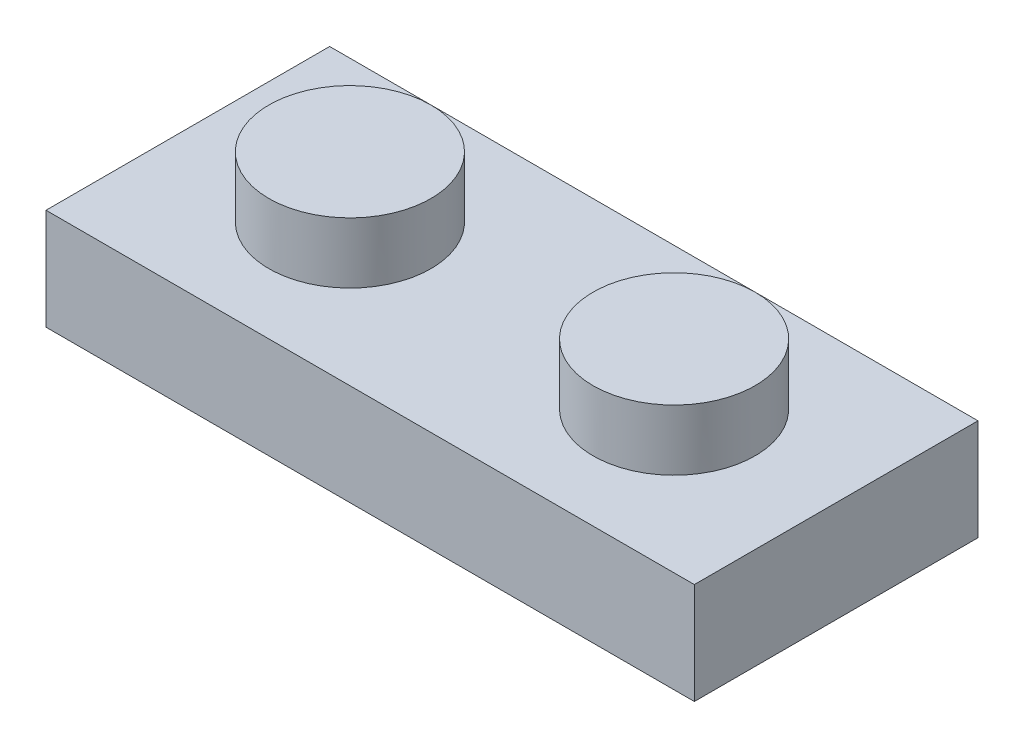
ISO-10303-21;
HEADER;
FILE_DESCRIPTION(('STEP AP214'),'2;1');
FILE_NAME('part.step','',(''),(''),'','','');
FILE_SCHEMA(('AUTOMOTIVE_DESIGN { 1 0 10303 214 1 1 1 1 }'));
ENDSEC;
DATA;
#1=APPLICATION_CONTEXT('core data for automotive mechanical design processes');
#2=APPLICATION_PROTOCOL_DEFINITION('international standard','automotive_design',2000,#1);
#3=PRODUCT_CONTEXT('',#1,'mechanical');
#4=PRODUCT('Part','Part','',(#3));
#5=PRODUCT_RELATED_PRODUCT_CATEGORY('part','',(#4));
#6=PRODUCT_DEFINITION_FORMATION('','',#4);
#7=PRODUCT_DEFINITION_CONTEXT('part definition',#1,'design');
#8=PRODUCT_DEFINITION('design','',#6,#7);
#9=PRODUCT_DEFINITION_SHAPE('','',#8);
#10=(LENGTH_UNIT() NAMED_UNIT(*) SI_UNIT(.MILLI.,.METRE.));
#11=(NAMED_UNIT(*) PLANE_ANGLE_UNIT() SI_UNIT($,.RADIAN.));
#12=(NAMED_UNIT(*) SI_UNIT($,.STERADIAN.) SOLID_ANGLE_UNIT());
#13=UNCERTAINTY_MEASURE_WITH_UNIT(LENGTH_MEASURE(1.E-05),#10,'distance_accuracy_value','');
#14=(GEOMETRIC_REPRESENTATION_CONTEXT(3) GLOBAL_UNCERTAINTY_ASSIGNED_CONTEXT((#13)) GLOBAL_UNIT_ASSIGNED_CONTEXT((#10,
#11,#12)) REPRESENTATION_CONTEXT('',''));
#15=CARTESIAN_POINT('',(0.,0.,0.));
#16=DIRECTION('',(0.,0.,1.));
#17=DIRECTION('',(1.,0.,0.));
#18=AXIS2_PLACEMENT_3D('',#15,#16,#17);
#19=CARTESIAN_POINT('',(-10.16,-3.175,4.445));
#20=DIRECTION('',(1.,0.,0.));
#21=DIRECTION('',(0.,0.,-1.));
#22=AXIS2_PLACEMENT_3D('',#19,#20,#21);
#23=PLANE('',#22);
#24=DIRECTION('',(0.,-1.,0.));
#25=VECTOR('',#24,1.);
#26=CARTESIAN_POINT('',(-10.16,-3.175,-4.445));
#27=LINE('',#26,#25);
#28=CARTESIAN_POINT('',(-10.16,0.,-4.445));
#29=VERTEX_POINT('',#28);
#30=CARTESIAN_POINT('',(-10.16,-3.175,-4.445));
#31=VERTEX_POINT('',#30);
#32=EDGE_CURVE('E176',#29,#31,#27,.T.);
#33=ORIENTED_EDGE('',*,*,#32,.T.);
#34=DIRECTION('',(0.,0.,-1.));
#35=VECTOR('',#34,1.);
#36=CARTESIAN_POINT('',(-10.16,-3.175,4.445));
#37=LINE('',#36,#35);
#38=CARTESIAN_POINT('',(-10.16,-3.175,4.445));
#39=VERTEX_POINT('',#38);
#40=EDGE_CURVE('E208',#39,#31,#37,.T.);
#41=ORIENTED_EDGE('',*,*,#40,.F.);
#42=DIRECTION('',(0.,-1.,0.));
#43=VECTOR('',#42,1.);
#44=CARTESIAN_POINT('',(-10.16,-3.175,4.445));
#45=LINE('',#44,#43);
#46=CARTESIAN_POINT('',(-10.16,0.,4.445));
#47=VERTEX_POINT('',#46);
#48=EDGE_CURVE('E177',#47,#39,#45,.T.);
#49=ORIENTED_EDGE('',*,*,#48,.F.);
#50=DIRECTION('',(0.,0.,-1.));
#51=VECTOR('',#50,1.);
#52=CARTESIAN_POINT('',(-10.16,0.,4.445));
#53=LINE('',#52,#51);
#54=EDGE_CURVE('E187',#47,#29,#53,.T.);
#55=ORIENTED_EDGE('',*,*,#54,.T.);
#56=EDGE_LOOP('',(#33,#41,#49,#55));
#57=FACE_BOUND('',#56,.T.);
#58=ADVANCED_FACE('F38',(#57),#23,.F.);
#59=CARTESIAN_POINT('',(10.16,-3.175,4.445));
#60=DIRECTION('',(0.,1.,0.));
#61=DIRECTION('',(0.,0.,1.));
#62=AXIS2_PLACEMENT_3D('',#59,#60,#61);
#63=PLANE('',#62);
#64=DIRECTION('',(0.,0.,-1.));
#65=VECTOR('',#64,1.);
#66=CARTESIAN_POINT('',(-8.89,-3.175,2.54));
#67=LINE('',#66,#65);
#68=CARTESIAN_POINT('',(-8.89,-3.175,2.54));
#69=VERTEX_POINT('',#68);
#70=CARTESIAN_POINT('',(-8.89,-3.175,-2.54));
#71=VERTEX_POINT('',#70);
#72=EDGE_CURVE('E153',#69,#71,#67,.T.);
#73=ORIENTED_EDGE('',*,*,#72,.F.);
#74=DIRECTION('',(-1.,0.,0.));
#75=VECTOR('',#74,1.);
#76=CARTESIAN_POINT('',(8.89,-3.175,2.54));
#77=LINE('',#76,#75);
#78=CARTESIAN_POINT('',(8.89,-3.175,2.54));
#79=VERTEX_POINT('',#78);
#80=EDGE_CURVE('E53',#79,#69,#77,.T.);
#81=ORIENTED_EDGE('',*,*,#80,.F.);
#82=DIRECTION('',(0.,0.,1.));
#83=VECTOR('',#82,1.);
#84=CARTESIAN_POINT('',(8.89,-3.175,-2.54));
#85=LINE('',#84,#83);
#86=CARTESIAN_POINT('',(8.89,-3.175,-2.54));
#87=VERTEX_POINT('',#86);
#88=EDGE_CURVE('E136',#87,#79,#85,.T.);
#89=ORIENTED_EDGE('',*,*,#88,.F.);
#90=DIRECTION('',(1.,0.,0.));
#91=VECTOR('',#90,1.);
#92=CARTESIAN_POINT('',(-8.89,-3.175,-2.54));
#93=LINE('',#92,#91);
#94=EDGE_CURVE('E141',#71,#87,#93,.T.);
#95=ORIENTED_EDGE('',*,*,#94,.F.);
#96=EDGE_LOOP('',(#73,#81,#89,#95));
#97=FACE_BOUND('',#96,.T.);
#98=DIRECTION('',(1.,0.,0.));
#99=VECTOR('',#98,1.);
#100=CARTESIAN_POINT('',(10.16,-3.175,-4.445));
#101=LINE('',#100,#99);
#102=CARTESIAN_POINT('',(10.16,-3.175,-4.445));
#103=VERTEX_POINT('',#102);
#104=EDGE_CURVE('E191',#31,#103,#101,.T.);
#105=ORIENTED_EDGE('',*,*,#104,.T.);
#106=DIRECTION('',(0.,0.,-1.));
#107=VECTOR('',#106,1.);
#108=CARTESIAN_POINT('',(10.16,-3.175,4.445));
#109=LINE('',#108,#107);
#110=CARTESIAN_POINT('',(10.16,-3.175,4.445));
#111=VERTEX_POINT('',#110);
#112=EDGE_CURVE('E204',#111,#103,#109,.T.);
#113=ORIENTED_EDGE('',*,*,#112,.F.);
#114=DIRECTION('',(1.,0.,0.));
#115=VECTOR('',#114,1.);
#116=CARTESIAN_POINT('',(10.16,-3.175,4.445));
#117=LINE('',#116,#115);
#118=EDGE_CURVE('E91',#39,#111,#117,.T.);
#119=ORIENTED_EDGE('',*,*,#118,.F.);
#120=ORIENTED_EDGE('',*,*,#40,.T.);
#121=EDGE_LOOP('',(#105,#113,#119,#120));
#122=FACE_BOUND('',#121,.T.);
#123=ADVANCED_FACE('F246',(#97,#122),#63,.F.);
#124=CARTESIAN_POINT('',(10.16,0.,4.445));
#125=DIRECTION('',(-1.,0.,0.));
#126=DIRECTION('',(0.,0.,1.));
#127=AXIS2_PLACEMENT_3D('',#124,#125,#126);
#128=PLANE('',#127);
#129=DIRECTION('',(0.,1.,0.));
#130=VECTOR('',#129,1.);
#131=CARTESIAN_POINT('',(10.16,0.,-4.445));
#132=LINE('',#131,#130);
#133=CARTESIAN_POINT('',(10.16,0.,-4.445));
#134=VERTEX_POINT('',#133);
#135=EDGE_CURVE('E194',#103,#134,#132,.T.);
#136=ORIENTED_EDGE('',*,*,#135,.T.);
#137=DIRECTION('',(0.,0.,-1.));
#138=VECTOR('',#137,1.);
#139=CARTESIAN_POINT('',(10.16,0.,4.445));
#140=LINE('',#139,#138);
#141=CARTESIAN_POINT('',(10.16,0.,4.445));
#142=VERTEX_POINT('',#141);
#143=EDGE_CURVE('E201',#142,#134,#140,.T.);
#144=ORIENTED_EDGE('',*,*,#143,.F.);
#145=DIRECTION('',(0.,1.,0.));
#146=VECTOR('',#145,1.);
#147=CARTESIAN_POINT('',(10.16,0.,4.445));
#148=LINE('',#147,#146);
#149=EDGE_CURVE('E182',#111,#142,#148,.T.);
#150=ORIENTED_EDGE('',*,*,#149,.F.);
#151=ORIENTED_EDGE('',*,*,#112,.T.);
#152=EDGE_LOOP('',(#136,#144,#150,#151));
#153=FACE_BOUND('',#152,.T.);
#154=ADVANCED_FACE('F225',(#153),#128,.F.);
#155=CARTESIAN_POINT('',(-10.16,0.,4.445));
#156=DIRECTION('',(0.,-1.,0.));
#157=DIRECTION('',(0.,0.,-1.));
#158=AXIS2_PLACEMENT_3D('',#155,#156,#157);
#159=PLANE('',#158);
#160=CARTESIAN_POINT('',(5.08,0.,0.));
#161=DIRECTION('',(0.,-1.,0.));
#162=DIRECTION('',(0.,0.,-1.));
#163=AXIS2_PLACEMENT_3D('',#160,#161,#162);
#164=CIRCLE('',#163,2.54);
#165=CARTESIAN_POINT('',(5.08,0.,-2.54));
#166=VERTEX_POINT('',#165);
#167=EDGE_CURVE('E46',#166,#166,#164,.F.);
#168=ORIENTED_EDGE('',*,*,#167,.F.);
#169=EDGE_LOOP('',(#168));
#170=FACE_BOUND('',#169,.T.);
#171=CARTESIAN_POINT('',(-5.08,0.,0.));
#172=DIRECTION('',(0.,-1.,0.));
#173=DIRECTION('',(0.,0.,-1.));
#174=AXIS2_PLACEMENT_3D('',#171,#172,#173);
#175=CIRCLE('',#174,2.54);
#176=CARTESIAN_POINT('',(-5.08,0.,-2.54));
#177=VERTEX_POINT('',#176);
#178=EDGE_CURVE('E211',#177,#177,#175,.F.);
#179=ORIENTED_EDGE('',*,*,#178,.F.);
#180=EDGE_LOOP('',(#179));
#181=FACE_BOUND('',#180,.T.);
#182=DIRECTION('',(-1.,0.,0.));
#183=VECTOR('',#182,1.);
#184=CARTESIAN_POINT('',(-10.16,0.,-4.445));
#185=LINE('',#184,#183);
#186=EDGE_CURVE('E83',#134,#29,#185,.T.);
#187=ORIENTED_EDGE('',*,*,#186,.T.);
#188=ORIENTED_EDGE('',*,*,#54,.F.);
#189=DIRECTION('',(-1.,0.,0.));
#190=VECTOR('',#189,1.);
#191=CARTESIAN_POINT('',(-10.16,0.,4.445));
#192=LINE('',#191,#190);
#193=EDGE_CURVE('E62',#142,#47,#192,.T.);
#194=ORIENTED_EDGE('',*,*,#193,.F.);
#195=ORIENTED_EDGE('',*,*,#143,.T.);
#196=EDGE_LOOP('',(#187,#188,#194,#195));
#197=FACE_BOUND('',#196,.T.);
#198=ADVANCED_FACE('F221',(#170,#181,#197),#159,.F.);
#199=CARTESIAN_POINT('',(0.,0.,4.445));
#200=DIRECTION('',(0.,0.,-1.));
#201=DIRECTION('',(-1.,0.,0.));
#202=AXIS2_PLACEMENT_3D('',#199,#200,#201);
#203=PLANE('',#202);
#204=ORIENTED_EDGE('',*,*,#48,.T.);
#205=ORIENTED_EDGE('',*,*,#118,.T.);
#206=ORIENTED_EDGE('',*,*,#149,.T.);
#207=ORIENTED_EDGE('',*,*,#193,.T.);
#208=EDGE_LOOP('',(#204,#205,#206,#207));
#209=FACE_BOUND('',#208,.T.);
#210=ADVANCED_FACE('F224',(#209),#203,.F.);
#211=CARTESIAN_POINT('',(0.,0.,-4.445));
#212=DIRECTION('',(0.,0.,-1.));
#213=DIRECTION('',(-1.,0.,0.));
#214=AXIS2_PLACEMENT_3D('',#211,#212,#213);
#215=PLANE('',#214);
#216=ORIENTED_EDGE('',*,*,#32,.F.);
#217=ORIENTED_EDGE('',*,*,#186,.F.);
#218=ORIENTED_EDGE('',*,*,#135,.F.);
#219=ORIENTED_EDGE('',*,*,#104,.F.);
#220=EDGE_LOOP('',(#216,#217,#218,#219));
#221=FACE_BOUND('',#220,.T.);
#222=ADVANCED_FACE('F232',(#221),#215,.T.);
#223=CARTESIAN_POINT('',(-5.08,1.905,0.));
#224=DIRECTION('',(0.,-1.,0.));
#225=DIRECTION('',(0.,0.,-1.));
#226=AXIS2_PLACEMENT_3D('',#223,#224,#225);
#227=CYLINDRICAL_SURFACE('',#226,2.54);
#228=CARTESIAN_POINT('',(-5.08,1.905,0.));
#229=DIRECTION('',(0.,1.,0.));
#230=DIRECTION('',(0.,0.,1.));
#231=AXIS2_PLACEMENT_3D('',#228,#229,#230);
#232=CIRCLE('',#231,2.54);
#233=CARTESIAN_POINT('',(-5.08,1.905,2.54));
#234=VERTEX_POINT('',#233);
#235=EDGE_CURVE('E172',#234,#234,#232,.T.);
#236=ORIENTED_EDGE('',*,*,#235,.F.);
#237=EDGE_LOOP('',(#236));
#238=FACE_BOUND('',#237,.T.);
#239=ORIENTED_EDGE('',*,*,#178,.T.);
#240=EDGE_LOOP('',(#239));
#241=FACE_BOUND('',#240,.T.);
#242=ADVANCED_FACE('F229',(#238,#241),#227,.T.);
#243=CARTESIAN_POINT('',(-5.08,1.905,0.));
#244=DIRECTION('',(0.,1.,0.));
#245=DIRECTION('',(0.,0.,1.));
#246=AXIS2_PLACEMENT_3D('',#243,#244,#245);
#247=PLANE('',#246);
#248=ORIENTED_EDGE('',*,*,#235,.T.);
#249=EDGE_LOOP('',(#248));
#250=FACE_BOUND('',#249,.T.);
#251=ADVANCED_FACE('F231',(#250),#247,.T.);
#252=CARTESIAN_POINT('',(5.08,1.905,0.));
#253=DIRECTION('',(0.,-1.,0.));
#254=DIRECTION('',(0.,0.,-1.));
#255=AXIS2_PLACEMENT_3D('',#252,#253,#254);
#256=CYLINDRICAL_SURFACE('',#255,2.54);
#257=CARTESIAN_POINT('',(5.08,1.905,0.));
#258=DIRECTION('',(0.,1.,0.));
#259=DIRECTION('',(0.,0.,1.));
#260=AXIS2_PLACEMENT_3D('',#257,#258,#259);
#261=CIRCLE('',#260,2.54);
#262=CARTESIAN_POINT('',(5.08,1.905,2.54));
#263=VERTEX_POINT('',#262);
#264=EDGE_CURVE('E163',#263,#263,#261,.T.);
#265=ORIENTED_EDGE('',*,*,#264,.F.);
#266=EDGE_LOOP('',(#265));
#267=FACE_BOUND('',#266,.T.);
#268=ORIENTED_EDGE('',*,*,#167,.T.);
#269=EDGE_LOOP('',(#268));
#270=FACE_BOUND('',#269,.T.);
#271=ADVANCED_FACE('F219',(#267,#270),#256,.T.);
#272=CARTESIAN_POINT('',(5.08,1.905,0.));
#273=DIRECTION('',(0.,1.,0.));
#274=DIRECTION('',(0.,0.,1.));
#275=AXIS2_PLACEMENT_3D('',#272,#273,#274);
#276=PLANE('',#275);
#277=ORIENTED_EDGE('',*,*,#264,.T.);
#278=EDGE_LOOP('',(#277));
#279=FACE_BOUND('',#278,.T.);
#280=ADVANCED_FACE('F301',(#279),#276,.T.);
#281=CARTESIAN_POINT('',(8.89,-1.27,2.54));
#282=DIRECTION('',(0.,0.,1.));
#283=DIRECTION('',(1.,0.,0.));
#284=AXIS2_PLACEMENT_3D('',#281,#282,#283);
#285=PLANE('',#284);
#286=ORIENTED_EDGE('',*,*,#80,.T.);
#287=DIRECTION('',(0.,-1.,0.));
#288=VECTOR('',#287,1.);
#289=CARTESIAN_POINT('',(-8.89,-1.27,2.54));
#290=LINE('',#289,#288);
#291=CARTESIAN_POINT('',(-8.89,-1.27,2.54));
#292=VERTEX_POINT('',#291);
#293=EDGE_CURVE('E111',#292,#69,#290,.T.);
#294=ORIENTED_EDGE('',*,*,#293,.F.);
#295=DIRECTION('',(-1.,0.,0.));
#296=VECTOR('',#295,1.);
#297=CARTESIAN_POINT('',(8.89,-1.27,2.54));
#298=LINE('',#297,#296);
#299=CARTESIAN_POINT('',(8.89,-1.27,2.54));
#300=VERTEX_POINT('',#299);
#301=EDGE_CURVE('E115',#300,#292,#298,.T.);
#302=ORIENTED_EDGE('',*,*,#301,.F.);
#303=DIRECTION('',(0.,-1.,0.));
#304=VECTOR('',#303,1.);
#305=CARTESIAN_POINT('',(8.89,-1.27,2.54));
#306=LINE('',#305,#304);
#307=EDGE_CURVE('E160',#300,#79,#306,.T.);
#308=ORIENTED_EDGE('',*,*,#307,.T.);
#309=EDGE_LOOP('',(#286,#294,#302,#308));
#310=FACE_BOUND('',#309,.T.);
#311=ADVANCED_FACE('F113',(#310),#285,.F.);
#312=CARTESIAN_POINT('',(8.89,-1.27,-2.54));
#313=DIRECTION('',(1.,0.,0.));
#314=DIRECTION('',(0.,0.,-1.));
#315=AXIS2_PLACEMENT_3D('',#312,#313,#314);
#316=PLANE('',#315);
#317=ORIENTED_EDGE('',*,*,#88,.T.);
#318=ORIENTED_EDGE('',*,*,#307,.F.);
#319=DIRECTION('',(0.,0.,1.));
#320=VECTOR('',#319,1.);
#321=CARTESIAN_POINT('',(8.89,-1.27,-2.54));
#322=LINE('',#321,#320);
#323=CARTESIAN_POINT('',(8.89,-1.27,-2.54));
#324=VERTEX_POINT('',#323);
#325=EDGE_CURVE('E122',#324,#300,#322,.T.);
#326=ORIENTED_EDGE('',*,*,#325,.F.);
#327=DIRECTION('',(0.,-1.,0.));
#328=VECTOR('',#327,1.);
#329=CARTESIAN_POINT('',(8.89,-1.27,-2.54));
#330=LINE('',#329,#328);
#331=EDGE_CURVE('E164',#324,#87,#330,.T.);
#332=ORIENTED_EDGE('',*,*,#331,.T.);
#333=EDGE_LOOP('',(#317,#318,#326,#332));
#334=FACE_BOUND('',#333,.T.);
#335=ADVANCED_FACE('F321',(#334),#316,.F.);
#336=CARTESIAN_POINT('',(-8.89,-1.27,-2.54));
#337=DIRECTION('',(0.,0.,-1.));
#338=DIRECTION('',(-1.,0.,0.));
#339=AXIS2_PLACEMENT_3D('',#336,#337,#338);
#340=PLANE('',#339);
#341=ORIENTED_EDGE('',*,*,#94,.T.);
#342=ORIENTED_EDGE('',*,*,#331,.F.);
#343=DIRECTION('',(1.,0.,0.));
#344=VECTOR('',#343,1.);
#345=CARTESIAN_POINT('',(-8.89,-1.27,-2.54));
#346=LINE('',#345,#344);
#347=CARTESIAN_POINT('',(-8.89,-1.27,-2.54));
#348=VERTEX_POINT('',#347);
#349=EDGE_CURVE('E131',#348,#324,#346,.T.);
#350=ORIENTED_EDGE('',*,*,#349,.F.);
#351=DIRECTION('',(0.,-1.,0.));
#352=VECTOR('',#351,1.);
#353=CARTESIAN_POINT('',(-8.89,-1.27,-2.54));
#354=LINE('',#353,#352);
#355=EDGE_CURVE('E121',#348,#71,#354,.T.);
#356=ORIENTED_EDGE('',*,*,#355,.T.);
#357=EDGE_LOOP('',(#341,#342,#350,#356));
#358=FACE_BOUND('',#357,.T.);
#359=ADVANCED_FACE('F330',(#358),#340,.F.);
#360=CARTESIAN_POINT('',(-8.89,-1.27,2.54));
#361=DIRECTION('',(-1.,0.,0.));
#362=DIRECTION('',(0.,0.,1.));
#363=AXIS2_PLACEMENT_3D('',#360,#361,#362);
#364=PLANE('',#363);
#365=ORIENTED_EDGE('',*,*,#72,.T.);
#366=ORIENTED_EDGE('',*,*,#355,.F.);
#367=DIRECTION('',(0.,0.,-1.));
#368=VECTOR('',#367,1.);
#369=CARTESIAN_POINT('',(-8.89,-1.27,2.54));
#370=LINE('',#369,#368);
#371=EDGE_CURVE('E125',#292,#348,#370,.T.);
#372=ORIENTED_EDGE('',*,*,#371,.F.);
#373=ORIENTED_EDGE('',*,*,#293,.T.);
#374=EDGE_LOOP('',(#365,#366,#372,#373));
#375=FACE_BOUND('',#374,.T.);
#376=ADVANCED_FACE('F126',(#375),#364,.F.);
#377=CARTESIAN_POINT('',(0.,-1.27,0.));
#378=DIRECTION('',(0.,-1.,0.));
#379=DIRECTION('',(0.,0.,-1.));
#380=AXIS2_PLACEMENT_3D('',#377,#378,#379);
#381=PLANE('',#380);
#382=CARTESIAN_POINT('',(0.,-1.27,0.));
#383=DIRECTION('',(0.,-1.,0.));
#384=DIRECTION('',(0.,0.,-1.));
#385=AXIS2_PLACEMENT_3D('',#382,#383,#384);
#386=CIRCLE('',#385,1.905);
#387=CARTESIAN_POINT('',(0.,-1.27,-1.905));
#388=VERTEX_POINT('',#387);
#389=EDGE_CURVE('E505',#388,#388,#386,.T.);
#390=ORIENTED_EDGE('',*,*,#389,.F.);
#391=EDGE_LOOP('',(#390));
#392=FACE_BOUND('',#391,.T.);
#393=CARTESIAN_POINT('',(-5.08,-1.27,0.));
#394=DIRECTION('',(0.,-1.,0.));
#395=DIRECTION('',(0.,0.,-1.));
#396=AXIS2_PLACEMENT_3D('',#393,#394,#395);
#397=CIRCLE('',#396,1.905);
#398=CARTESIAN_POINT('',(-5.08,-1.27,-1.905));
#399=VERTEX_POINT('',#398);
#400=EDGE_CURVE('E517',#399,#399,#397,.T.);
#401=ORIENTED_EDGE('',*,*,#400,.F.);
#402=EDGE_LOOP('',(#401));
#403=FACE_BOUND('',#402,.T.);
#404=CARTESIAN_POINT('',(5.08,-1.27,0.));
#405=DIRECTION('',(0.,-1.,0.));
#406=DIRECTION('',(0.,0.,-1.));
#407=AXIS2_PLACEMENT_3D('',#404,#405,#406);
#408=CIRCLE('',#407,1.905);
#409=CARTESIAN_POINT('',(5.08,-1.27,-1.905));
#410=VERTEX_POINT('',#409);
#411=EDGE_CURVE('E144',#410,#410,#408,.T.);
#412=ORIENTED_EDGE('',*,*,#411,.F.);
#413=EDGE_LOOP('',(#412));
#414=FACE_BOUND('',#413,.T.);
#415=ORIENTED_EDGE('',*,*,#301,.T.);
#416=ORIENTED_EDGE('',*,*,#371,.T.);
#417=ORIENTED_EDGE('',*,*,#349,.T.);
#418=ORIENTED_EDGE('',*,*,#325,.T.);
#419=EDGE_LOOP('',(#415,#416,#417,#418));
#420=FACE_BOUND('',#419,.T.);
#421=ADVANCED_FACE('F133',(#392,#403,#414,#420),#381,.T.);
#422=CARTESIAN_POINT('',(5.08,1.27,0.));
#423=DIRECTION('',(0.,-1.,0.));
#424=DIRECTION('',(0.,0.,-1.));
#425=AXIS2_PLACEMENT_3D('',#422,#423,#424);
#426=CYLINDRICAL_SURFACE('',#425,1.905);
#427=CARTESIAN_POINT('',(5.08,1.27,0.));
#428=DIRECTION('',(0.,-1.,0.));
#429=DIRECTION('',(0.,0.,-1.));
#430=AXIS2_PLACEMENT_3D('',#427,#428,#429);
#431=CIRCLE('',#430,1.905);
#432=CARTESIAN_POINT('',(5.08,1.27,-1.905));
#433=VERTEX_POINT('',#432);
#434=EDGE_CURVE('E520',#433,#433,#431,.T.);
#435=ORIENTED_EDGE('',*,*,#434,.F.);
#436=EDGE_LOOP('',(#435));
#437=FACE_BOUND('',#436,.T.);
#438=ORIENTED_EDGE('',*,*,#411,.T.);
#439=EDGE_LOOP('',(#438));
#440=FACE_BOUND('',#439,.T.);
#441=ADVANCED_FACE('F358',(#437,#440),#426,.F.);
#442=CARTESIAN_POINT('',(5.08,1.27,0.));
#443=DIRECTION('',(0.,-1.,0.));
#444=DIRECTION('',(0.,0.,-1.));
#445=AXIS2_PLACEMENT_3D('',#442,#443,#444);
#446=PLANE('',#445);
#447=ORIENTED_EDGE('',*,*,#434,.T.);
#448=EDGE_LOOP('',(#447));
#449=FACE_BOUND('',#448,.T.);
#450=ADVANCED_FACE('F370',(#449),#446,.T.);
#451=CARTESIAN_POINT('',(-5.08,1.27,0.));
#452=DIRECTION('',(0.,-1.,0.));
#453=DIRECTION('',(0.,0.,-1.));
#454=AXIS2_PLACEMENT_3D('',#451,#452,#453);
#455=CYLINDRICAL_SURFACE('',#454,1.905);
#456=CARTESIAN_POINT('',(-5.08,1.27,0.));
#457=DIRECTION('',(0.,-1.,0.));
#458=DIRECTION('',(0.,0.,-1.));
#459=AXIS2_PLACEMENT_3D('',#456,#457,#458);
#460=CIRCLE('',#459,1.905);
#461=CARTESIAN_POINT('',(-5.08,1.27,-1.905));
#462=VERTEX_POINT('',#461);
#463=EDGE_CURVE('E154',#462,#462,#460,.T.);
#464=ORIENTED_EDGE('',*,*,#463,.F.);
#465=EDGE_LOOP('',(#464));
#466=FACE_BOUND('',#465,.T.);
#467=ORIENTED_EDGE('',*,*,#400,.T.);
#468=EDGE_LOOP('',(#467));
#469=FACE_BOUND('',#468,.T.);
#470=ADVANCED_FACE('F380',(#466,#469),#455,.F.);
#471=CARTESIAN_POINT('',(-5.08,1.27,0.));
#472=DIRECTION('',(0.,-1.,0.));
#473=DIRECTION('',(0.,0.,-1.));
#474=AXIS2_PLACEMENT_3D('',#471,#472,#473);
#475=PLANE('',#474);
#476=ORIENTED_EDGE('',*,*,#463,.T.);
#477=EDGE_LOOP('',(#476));
#478=FACE_BOUND('',#477,.T.);
#479=ADVANCED_FACE('F390',(#478),#475,.T.);
#480=CARTESIAN_POINT('',(0.,-8.56315367264149,0.));
#481=DIRECTION('',(0.,1.,0.));
#482=DIRECTION('',(0.,0.,1.));
#483=AXIS2_PLACEMENT_3D('',#480,#481,#482);
#484=CYLINDRICAL_SURFACE('',#483,1.905);
#485=CARTESIAN_POINT('',(0.,-3.175,0.));
#486=DIRECTION('',(0.,1.,0.));
#487=DIRECTION('',(0.,0.,1.));
#488=AXIS2_PLACEMENT_3D('',#485,#486,#487);
#489=CIRCLE('',#488,1.905);
#490=CARTESIAN_POINT('',(0.,-3.175,1.905));
#491=VERTEX_POINT('',#490);
#492=EDGE_CURVE('E503',#491,#491,#489,.T.);
#493=ORIENTED_EDGE('',*,*,#492,.T.);
#494=EDGE_LOOP('',(#493));
#495=FACE_BOUND('',#494,.T.);
#496=ORIENTED_EDGE('',*,*,#389,.T.);
#497=EDGE_LOOP('',(#496));
#498=FACE_BOUND('',#497,.T.);
#499=ADVANCED_FACE('F399',(#495,#498),#484,.T.);
#500=CARTESIAN_POINT('',(0.,-8.56315367264149,0.));
#501=DIRECTION('',(0.,1.,0.));
#502=DIRECTION('',(0.,0.,1.));
#503=AXIS2_PLACEMENT_3D('',#500,#501,#502);
#504=CYLINDRICAL_SURFACE('',#503,0.9525);
#505=CARTESIAN_POINT('',(0.,-3.175,0.));
#506=DIRECTION('',(0.,1.,0.));
#507=DIRECTION('',(0.,0.,1.));
#508=AXIS2_PLACEMENT_3D('',#505,#506,#507);
#509=CIRCLE('',#508,0.9525);
#510=CARTESIAN_POINT('',(0.,-3.175,0.9525));
#511=VERTEX_POINT('',#510);
#512=EDGE_CURVE('E500',#511,#511,#509,.T.);
#513=ORIENTED_EDGE('',*,*,#512,.F.);
#514=EDGE_LOOP('',(#513));
#515=FACE_BOUND('',#514,.T.);
#516=CARTESIAN_POINT('',(0.,-1.27,0.));
#517=DIRECTION('',(0.,-1.,0.));
#518=DIRECTION('',(0.,0.,-1.));
#519=AXIS2_PLACEMENT_3D('',#516,#517,#518);
#520=CIRCLE('',#519,0.9525);
#521=CARTESIAN_POINT('',(0.,-1.27,-0.9525));
#522=VERTEX_POINT('',#521);
#523=EDGE_CURVE('E11',#522,#522,#520,.F.);
#524=ORIENTED_EDGE('',*,*,#523,.T.);
#525=EDGE_LOOP('',(#524));
#526=FACE_BOUND('',#525,.T.);
#527=ADVANCED_FACE('F408',(#515,#526),#504,.F.);
#528=CARTESIAN_POINT('',(10.16,-3.175,4.445));
#529=DIRECTION('',(0.,1.,0.));
#530=DIRECTION('',(0.,0.,1.));
#531=AXIS2_PLACEMENT_3D('',#528,#529,#530);
#532=PLANE('',#531);
#533=ORIENTED_EDGE('',*,*,#512,.T.);
#534=EDGE_LOOP('',(#533));
#535=FACE_BOUND('',#534,.T.);
#536=ORIENTED_EDGE('',*,*,#492,.F.);
#537=EDGE_LOOP('',(#536));
#538=FACE_BOUND('',#537,.T.);
#539=ADVANCED_FACE('F418',(#535,#538),#532,.F.);
#540=ORIENTED_EDGE('',*,*,#523,.F.);
#541=EDGE_LOOP('',(#540));
#542=FACE_BOUND('',#541,.T.);
#543=ADVANCED_FACE('F361',(#542),#381,.T.);
#544=CLOSED_SHELL('',(#58,#123,#154,#198,#210,#222,#242,#251,#271,#280,#311,#335,#359,#376,#421,
#441,#450,#470,#479,#499,#527,#539,#543));
#545=MANIFOLD_SOLID_BREP('B2',#544);
#546=ADVANCED_BREP_SHAPE_REPRESENTATION('',(#18,#545),#14);
#547=SHAPE_DEFINITION_REPRESENTATION(#9,#546);
ENDSEC;
END-ISO-10303-21;
